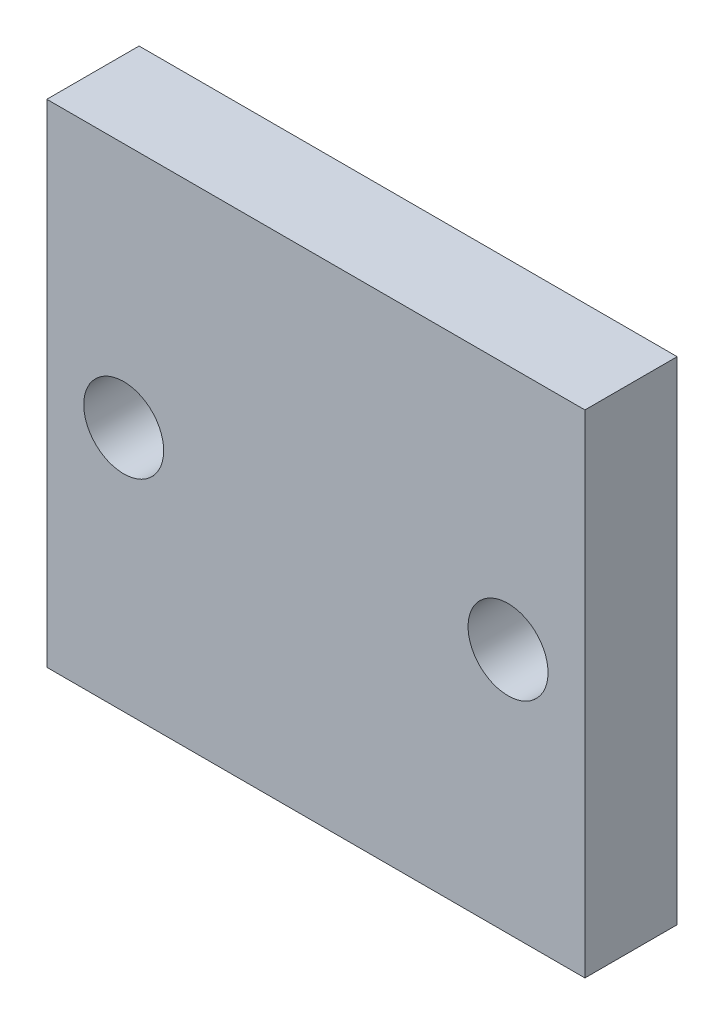
ISO-10303-21;
HEADER;
FILE_DESCRIPTION(('STEP AP214'),'2;1');
FILE_NAME('part.step','',(''),(''),'','','');
FILE_SCHEMA(('AUTOMOTIVE_DESIGN { 1 0 10303 214 1 1 1 1 }'));
ENDSEC;
DATA;
#1=APPLICATION_CONTEXT('core data for automotive mechanical design processes');
#2=APPLICATION_PROTOCOL_DEFINITION('international standard','automotive_design',2000,#1);
#3=PRODUCT_CONTEXT('',#1,'mechanical');
#4=PRODUCT('Part','Part','',(#3));
#5=PRODUCT_RELATED_PRODUCT_CATEGORY('part','',(#4));
#6=PRODUCT_DEFINITION_FORMATION('','',#4);
#7=PRODUCT_DEFINITION_CONTEXT('part definition',#1,'design');
#8=PRODUCT_DEFINITION('design','',#6,#7);
#9=PRODUCT_DEFINITION_SHAPE('','',#8);
#10=(LENGTH_UNIT() NAMED_UNIT(*) SI_UNIT(.MILLI.,.METRE.));
#11=(NAMED_UNIT(*) PLANE_ANGLE_UNIT() SI_UNIT($,.RADIAN.));
#12=(NAMED_UNIT(*) SI_UNIT($,.STERADIAN.) SOLID_ANGLE_UNIT());
#13=UNCERTAINTY_MEASURE_WITH_UNIT(LENGTH_MEASURE(1.E-05),#10,'distance_accuracy_value','');
#14=(GEOMETRIC_REPRESENTATION_CONTEXT(3) GLOBAL_UNCERTAINTY_ASSIGNED_CONTEXT((#13)) GLOBAL_UNIT_ASSIGNED_CONTEXT((#10,
#11,#12)) REPRESENTATION_CONTEXT('',''));
#15=CARTESIAN_POINT('',(0.,0.,0.));
#16=DIRECTION('',(0.,0.,1.));
#17=DIRECTION('',(1.,0.,0.));
#18=AXIS2_PLACEMENT_3D('',#15,#16,#17);
#19=CARTESIAN_POINT('',(0.,0.,6.));
#20=DIRECTION('',(0.,0.,-1.));
#21=DIRECTION('',(-1.,0.,0.));
#22=AXIS2_PLACEMENT_3D('',#19,#20,#21);
#23=PLANE('',#22);
#24=DIRECTION('',(0.,1.,0.));
#25=VECTOR('',#24,1.);
#26=CARTESIAN_POINT('',(17.5,-16.,6.));
#27=LINE('',#26,#25);
#28=CARTESIAN_POINT('',(17.5,-16.,6.));
#29=VERTEX_POINT('',#28);
#30=CARTESIAN_POINT('',(17.5,16.,6.));
#31=VERTEX_POINT('',#30);
#32=EDGE_CURVE('E85',#29,#31,#27,.T.);
#33=ORIENTED_EDGE('',*,*,#32,.T.);
#34=DIRECTION('',(-1.,0.,0.));
#35=VECTOR('',#34,1.);
#36=CARTESIAN_POINT('',(-17.5,16.,6.));
#37=LINE('',#36,#35);
#38=CARTESIAN_POINT('',(-17.5,16.,6.));
#39=VERTEX_POINT('',#38);
#40=EDGE_CURVE('E80',#31,#39,#37,.T.);
#41=ORIENTED_EDGE('',*,*,#40,.T.);
#42=DIRECTION('',(0.,-1.,0.));
#43=VECTOR('',#42,1.);
#44=CARTESIAN_POINT('',(-17.5,-16.,6.));
#45=LINE('',#44,#43);
#46=CARTESIAN_POINT('',(-17.5,-16.,6.));
#47=VERTEX_POINT('',#46);
#48=EDGE_CURVE('E83',#39,#47,#45,.T.);
#49=ORIENTED_EDGE('',*,*,#48,.T.);
#50=DIRECTION('',(1.,0.,0.));
#51=VECTOR('',#50,1.);
#52=CARTESIAN_POINT('',(-17.5,-16.,6.));
#53=LINE('',#52,#51);
#54=EDGE_CURVE('E50',#47,#29,#53,.T.);
#55=ORIENTED_EDGE('',*,*,#54,.T.);
#56=EDGE_LOOP('',(#33,#41,#49,#55));
#57=FACE_BOUND('',#56,.T.);
#58=CARTESIAN_POINT('',(-12.5,0.,6.));
#59=DIRECTION('',(0.,0.,1.));
#60=DIRECTION('',(1.,0.,0.));
#61=AXIS2_PLACEMENT_3D('',#58,#59,#60);
#62=CIRCLE('',#61,2.6);
#63=CARTESIAN_POINT('',(-9.9,0.,6.));
#64=VERTEX_POINT('',#63);
#65=EDGE_CURVE('E100',#64,#64,#62,.T.);
#66=ORIENTED_EDGE('',*,*,#65,.F.);
#67=EDGE_LOOP('',(#66));
#68=FACE_BOUND('',#67,.T.);
#69=CARTESIAN_POINT('',(12.5,0.,6.));
#70=DIRECTION('',(0.,0.,1.));
#71=DIRECTION('',(1.,0.,0.));
#72=AXIS2_PLACEMENT_3D('',#69,#70,#71);
#73=CIRCLE('',#72,2.6);
#74=CARTESIAN_POINT('',(15.1,0.,6.));
#75=VERTEX_POINT('',#74);
#76=EDGE_CURVE('E115',#75,#75,#73,.T.);
#77=ORIENTED_EDGE('',*,*,#76,.F.);
#78=EDGE_LOOP('',(#77));
#79=FACE_BOUND('',#78,.T.);
#80=ADVANCED_FACE('F33',(#57,#68,#79),#23,.F.);
#81=CARTESIAN_POINT('',(0.,0.,0.));
#82=DIRECTION('',(0.,0.,-1.));
#83=DIRECTION('',(-1.,0.,0.));
#84=AXIS2_PLACEMENT_3D('',#81,#82,#83);
#85=PLANE('',#84);
#86=CARTESIAN_POINT('',(-12.5,0.,0.));
#87=DIRECTION('',(0.,0.,1.));
#88=DIRECTION('',(1.,0.,0.));
#89=AXIS2_PLACEMENT_3D('',#86,#87,#88);
#90=CIRCLE('',#89,2.6);
#91=CARTESIAN_POINT('',(-9.9,0.,0.));
#92=VERTEX_POINT('',#91);
#93=EDGE_CURVE('E112',#92,#92,#90,.T.);
#94=ORIENTED_EDGE('',*,*,#93,.T.);
#95=EDGE_LOOP('',(#94));
#96=FACE_BOUND('',#95,.T.);
#97=DIRECTION('',(0.,1.,0.));
#98=VECTOR('',#97,1.);
#99=CARTESIAN_POINT('',(17.5,-16.,0.));
#100=LINE('',#99,#98);
#101=CARTESIAN_POINT('',(17.5,-16.,0.));
#102=VERTEX_POINT('',#101);
#103=CARTESIAN_POINT('',(17.5,16.,0.));
#104=VERTEX_POINT('',#103);
#105=EDGE_CURVE('E97',#102,#104,#100,.T.);
#106=ORIENTED_EDGE('',*,*,#105,.F.);
#107=DIRECTION('',(1.,0.,0.));
#108=VECTOR('',#107,1.);
#109=CARTESIAN_POINT('',(-17.5,-16.,0.));
#110=LINE('',#109,#108);
#111=CARTESIAN_POINT('',(-17.5,-16.,0.));
#112=VERTEX_POINT('',#111);
#113=EDGE_CURVE('E73',#112,#102,#110,.T.);
#114=ORIENTED_EDGE('',*,*,#113,.F.);
#115=DIRECTION('',(0.,-1.,0.));
#116=VECTOR('',#115,1.);
#117=CARTESIAN_POINT('',(-17.5,-16.,0.));
#118=LINE('',#117,#116);
#119=CARTESIAN_POINT('',(-17.5,16.,0.));
#120=VERTEX_POINT('',#119);
#121=EDGE_CURVE('E67',#120,#112,#118,.T.);
#122=ORIENTED_EDGE('',*,*,#121,.F.);
#123=DIRECTION('',(-1.,0.,0.));
#124=VECTOR('',#123,1.);
#125=CARTESIAN_POINT('',(-17.5,16.,0.));
#126=LINE('',#125,#124);
#127=EDGE_CURVE('E89',#104,#120,#126,.T.);
#128=ORIENTED_EDGE('',*,*,#127,.F.);
#129=EDGE_LOOP('',(#106,#114,#122,#128));
#130=FACE_BOUND('',#129,.T.);
#131=CARTESIAN_POINT('',(12.5,0.,0.));
#132=DIRECTION('',(0.,0.,1.));
#133=DIRECTION('',(1.,0.,0.));
#134=AXIS2_PLACEMENT_3D('',#131,#132,#133);
#135=CIRCLE('',#134,2.6);
#136=CARTESIAN_POINT('',(15.1,0.,0.));
#137=VERTEX_POINT('',#136);
#138=EDGE_CURVE('E118',#137,#137,#135,.T.);
#139=ORIENTED_EDGE('',*,*,#138,.T.);
#140=EDGE_LOOP('',(#139));
#141=FACE_BOUND('',#140,.T.);
#142=ADVANCED_FACE('F108',(#96,#130,#141),#85,.T.);
#143=CARTESIAN_POINT('',(17.5,-16.,6.));
#144=DIRECTION('',(-1.,0.,0.));
#145=DIRECTION('',(0.,0.,1.));
#146=AXIS2_PLACEMENT_3D('',#143,#144,#145);
#147=PLANE('',#146);
#148=ORIENTED_EDGE('',*,*,#105,.T.);
#149=DIRECTION('',(0.,0.,-1.));
#150=VECTOR('',#149,1.);
#151=CARTESIAN_POINT('',(17.5,16.,6.));
#152=LINE('',#151,#150);
#153=EDGE_CURVE('E11',#31,#104,#152,.T.);
#154=ORIENTED_EDGE('',*,*,#153,.F.);
#155=ORIENTED_EDGE('',*,*,#32,.F.);
#156=DIRECTION('',(0.,0.,-1.));
#157=VECTOR('',#156,1.);
#158=CARTESIAN_POINT('',(17.5,-16.,6.));
#159=LINE('',#158,#157);
#160=EDGE_CURVE('E93',#29,#102,#159,.T.);
#161=ORIENTED_EDGE('',*,*,#160,.T.);
#162=EDGE_LOOP('',(#148,#154,#155,#161));
#163=FACE_BOUND('',#162,.T.);
#164=ADVANCED_FACE('F35',(#163),#147,.F.);
#165=CARTESIAN_POINT('',(-17.5,16.,6.));
#166=DIRECTION('',(0.,-1.,0.));
#167=DIRECTION('',(0.,0.,-1.));
#168=AXIS2_PLACEMENT_3D('',#165,#166,#167);
#169=PLANE('',#168);
#170=ORIENTED_EDGE('',*,*,#127,.T.);
#171=DIRECTION('',(0.,0.,-1.));
#172=VECTOR('',#171,1.);
#173=CARTESIAN_POINT('',(-17.5,16.,6.));
#174=LINE('',#173,#172);
#175=EDGE_CURVE('E42',#39,#120,#174,.T.);
#176=ORIENTED_EDGE('',*,*,#175,.F.);
#177=ORIENTED_EDGE('',*,*,#40,.F.);
#178=ORIENTED_EDGE('',*,*,#153,.T.);
#179=EDGE_LOOP('',(#170,#176,#177,#178));
#180=FACE_BOUND('',#179,.T.);
#181=ADVANCED_FACE('F88',(#180),#169,.F.);
#182=CARTESIAN_POINT('',(-17.5,-16.,6.));
#183=DIRECTION('',(1.,0.,0.));
#184=DIRECTION('',(0.,0.,-1.));
#185=AXIS2_PLACEMENT_3D('',#182,#183,#184);
#186=PLANE('',#185);
#187=ORIENTED_EDGE('',*,*,#121,.T.);
#188=DIRECTION('',(0.,0.,-1.));
#189=VECTOR('',#188,1.);
#190=CARTESIAN_POINT('',(-17.5,-16.,6.));
#191=LINE('',#190,#189);
#192=EDGE_CURVE('E90',#47,#112,#191,.T.);
#193=ORIENTED_EDGE('',*,*,#192,.F.);
#194=ORIENTED_EDGE('',*,*,#48,.F.);
#195=ORIENTED_EDGE('',*,*,#175,.T.);
#196=EDGE_LOOP('',(#187,#193,#194,#195));
#197=FACE_BOUND('',#196,.T.);
#198=ADVANCED_FACE('F91',(#197),#186,.F.);
#199=CARTESIAN_POINT('',(-17.5,-16.,6.));
#200=DIRECTION('',(0.,1.,0.));
#201=DIRECTION('',(0.,0.,1.));
#202=AXIS2_PLACEMENT_3D('',#199,#200,#201);
#203=PLANE('',#202);
#204=ORIENTED_EDGE('',*,*,#113,.T.);
#205=ORIENTED_EDGE('',*,*,#160,.F.);
#206=ORIENTED_EDGE('',*,*,#54,.F.);
#207=ORIENTED_EDGE('',*,*,#192,.T.);
#208=EDGE_LOOP('',(#204,#205,#206,#207));
#209=FACE_BOUND('',#208,.T.);
#210=ADVANCED_FACE('F105',(#209),#203,.F.);
#211=CARTESIAN_POINT('',(-12.5,0.,6.));
#212=DIRECTION('',(0.,0.,-1.));
#213=DIRECTION('',(-1.,0.,0.));
#214=AXIS2_PLACEMENT_3D('',#211,#212,#213);
#215=CYLINDRICAL_SURFACE('',#214,2.6);
#216=ORIENTED_EDGE('',*,*,#65,.T.);
#217=EDGE_LOOP('',(#216));
#218=FACE_BOUND('',#217,.T.);
#219=ORIENTED_EDGE('',*,*,#93,.F.);
#220=EDGE_LOOP('',(#219));
#221=FACE_BOUND('',#220,.T.);
#222=ADVANCED_FACE('F135',(#218,#221),#215,.F.);
#223=CARTESIAN_POINT('',(12.5,0.,6.));
#224=DIRECTION('',(0.,0.,-1.));
#225=DIRECTION('',(-1.,0.,0.));
#226=AXIS2_PLACEMENT_3D('',#223,#224,#225);
#227=CYLINDRICAL_SURFACE('',#226,2.6);
#228=ORIENTED_EDGE('',*,*,#76,.T.);
#229=EDGE_LOOP('',(#228));
#230=FACE_BOUND('',#229,.T.);
#231=ORIENTED_EDGE('',*,*,#138,.F.);
#232=EDGE_LOOP('',(#231));
#233=FACE_BOUND('',#232,.T.);
#234=ADVANCED_FACE('F124',(#230,#233),#227,.F.);
#235=CLOSED_SHELL('',(#80,#142,#164,#181,#198,#210,#222,#234));
#236=MANIFOLD_SOLID_BREP('B2',#235);
#237=ADVANCED_BREP_SHAPE_REPRESENTATION('',(#18,#236),#14);
#238=SHAPE_DEFINITION_REPRESENTATION(#9,#237);
ENDSEC;
END-ISO-10303-21;
